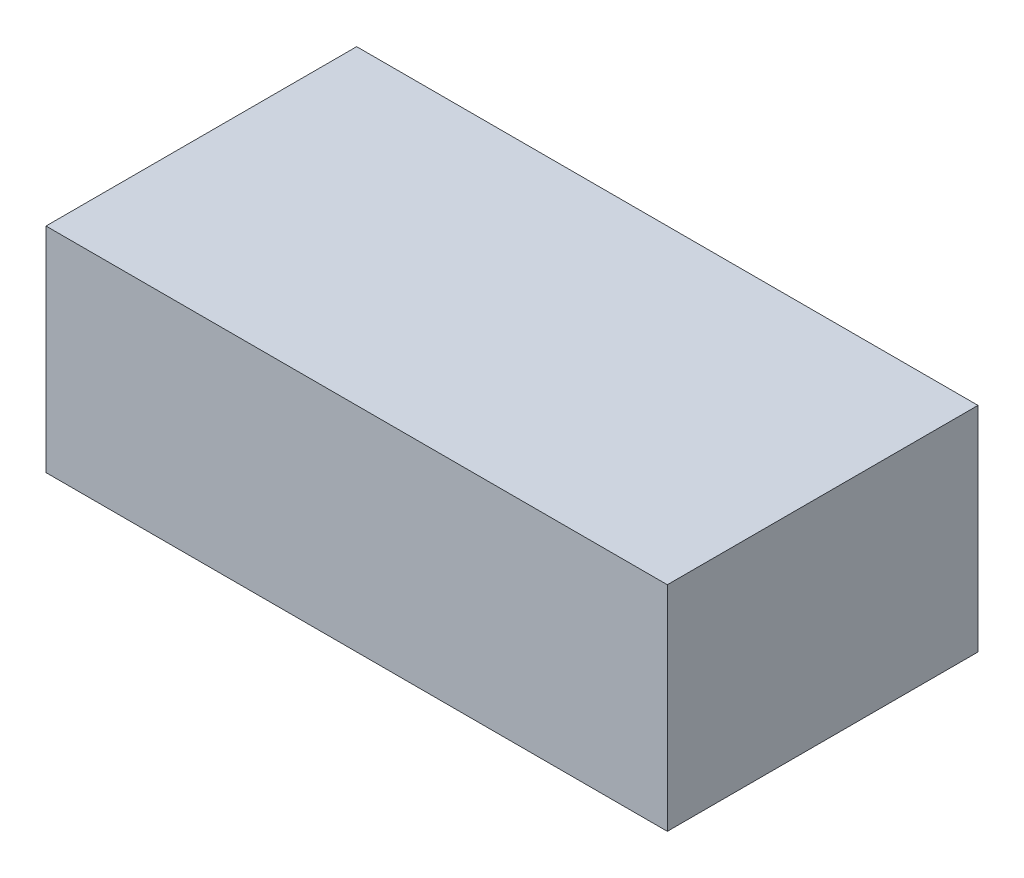
ISO-10303-21;
HEADER;
FILE_DESCRIPTION(('STEP AP214'),'2;1');
FILE_NAME('part.step','',(''),(''),'','','');
FILE_SCHEMA(('AUTOMOTIVE_DESIGN { 1 0 10303 214 1 1 1 1 }'));
ENDSEC;
DATA;
#1=APPLICATION_CONTEXT('core data for automotive mechanical design processes');
#2=APPLICATION_PROTOCOL_DEFINITION('international standard','automotive_design',2000,#1);
#3=PRODUCT_CONTEXT('',#1,'mechanical');
#4=PRODUCT('Part','Part','',(#3));
#5=PRODUCT_RELATED_PRODUCT_CATEGORY('part','',(#4));
#6=PRODUCT_DEFINITION_FORMATION('','',#4);
#7=PRODUCT_DEFINITION_CONTEXT('part definition',#1,'design');
#8=PRODUCT_DEFINITION('design','',#6,#7);
#9=PRODUCT_DEFINITION_SHAPE('','',#8);
#10=(LENGTH_UNIT() NAMED_UNIT(*) SI_UNIT(.MILLI.,.METRE.));
#11=(NAMED_UNIT(*) PLANE_ANGLE_UNIT() SI_UNIT($,.RADIAN.));
#12=(NAMED_UNIT(*) SI_UNIT($,.STERADIAN.) SOLID_ANGLE_UNIT());
#13=UNCERTAINTY_MEASURE_WITH_UNIT(LENGTH_MEASURE(1.E-05),#10,'distance_accuracy_value','');
#14=(GEOMETRIC_REPRESENTATION_CONTEXT(3) GLOBAL_UNCERTAINTY_ASSIGNED_CONTEXT((#13)) GLOBAL_UNIT_ASSIGNED_CONTEXT((#10,
#11,#12)) REPRESENTATION_CONTEXT('',''));
#15=CARTESIAN_POINT('',(0.,0.,0.));
#16=DIRECTION('',(0.,0.,1.));
#17=DIRECTION('',(1.,0.,0.));
#18=AXIS2_PLACEMENT_3D('',#15,#16,#17);
#19=CARTESIAN_POINT('',(0.8,0.55,-0.4));
#20=DIRECTION('',(-1.,0.,0.));
#21=DIRECTION('',(0.,0.,1.));
#22=AXIS2_PLACEMENT_3D('',#19,#20,#21);
#23=PLANE('',#22);
#24=DIRECTION('',(0.,0.,-1.));
#25=VECTOR('',#24,1.);
#26=CARTESIAN_POINT('',(0.8,0.,-0.4));
#27=LINE('',#26,#25);
#28=CARTESIAN_POINT('',(0.8,0.,0.4));
#29=VERTEX_POINT('',#28);
#30=CARTESIAN_POINT('',(0.8,0.,-0.4));
#31=VERTEX_POINT('',#30);
#32=EDGE_CURVE('E98',#29,#31,#27,.T.);
#33=ORIENTED_EDGE('',*,*,#32,.T.);
#34=DIRECTION('',(0.,-1.,0.));
#35=VECTOR('',#34,1.);
#36=CARTESIAN_POINT('',(0.8,0.55,-0.4));
#37=LINE('',#36,#35);
#38=CARTESIAN_POINT('',(0.8,0.55,-0.4));
#39=VERTEX_POINT('',#38);
#40=EDGE_CURVE('E11',#39,#31,#37,.T.);
#41=ORIENTED_EDGE('',*,*,#40,.F.);
#42=DIRECTION('',(0.,0.,-1.));
#43=VECTOR('',#42,1.);
#44=CARTESIAN_POINT('',(0.8,0.55,-0.4));
#45=LINE('',#44,#43);
#46=CARTESIAN_POINT('',(0.8,0.55,0.4));
#47=VERTEX_POINT('',#46);
#48=EDGE_CURVE('E86',#47,#39,#45,.T.);
#49=ORIENTED_EDGE('',*,*,#48,.F.);
#50=DIRECTION('',(0.,-1.,0.));
#51=VECTOR('',#50,1.);
#52=CARTESIAN_POINT('',(0.8,0.55,0.4));
#53=LINE('',#52,#51);
#54=EDGE_CURVE('E94',#47,#29,#53,.T.);
#55=ORIENTED_EDGE('',*,*,#54,.T.);
#56=EDGE_LOOP('',(#33,#41,#49,#55));
#57=FACE_BOUND('',#56,.T.);
#58=ADVANCED_FACE('F35',(#57),#23,.F.);
#59=CARTESIAN_POINT('',(-0.8,0.55,-0.4));
#60=DIRECTION('',(0.,0.,1.));
#61=DIRECTION('',(1.,0.,0.));
#62=AXIS2_PLACEMENT_3D('',#59,#60,#61);
#63=PLANE('',#62);
#64=DIRECTION('',(-1.,0.,0.));
#65=VECTOR('',#64,1.);
#66=CARTESIAN_POINT('',(-0.8,0.,-0.4));
#67=LINE('',#66,#65);
#68=CARTESIAN_POINT('',(-0.8,0.,-0.4));
#69=VERTEX_POINT('',#68);
#70=EDGE_CURVE('E90',#31,#69,#67,.T.);
#71=ORIENTED_EDGE('',*,*,#70,.T.);
#72=DIRECTION('',(0.,-1.,0.));
#73=VECTOR('',#72,1.);
#74=CARTESIAN_POINT('',(-0.8,0.55,-0.4));
#75=LINE('',#74,#73);
#76=CARTESIAN_POINT('',(-0.8,0.55,-0.4));
#77=VERTEX_POINT('',#76);
#78=EDGE_CURVE('E43',#77,#69,#75,.T.);
#79=ORIENTED_EDGE('',*,*,#78,.F.);
#80=DIRECTION('',(-1.,0.,0.));
#81=VECTOR('',#80,1.);
#82=CARTESIAN_POINT('',(-0.8,0.55,-0.4));
#83=LINE('',#82,#81);
#84=EDGE_CURVE('E81',#39,#77,#83,.T.);
#85=ORIENTED_EDGE('',*,*,#84,.F.);
#86=ORIENTED_EDGE('',*,*,#40,.T.);
#87=EDGE_LOOP('',(#71,#79,#85,#86));
#88=FACE_BOUND('',#87,.T.);
#89=ADVANCED_FACE('F89',(#88),#63,.F.);
#90=CARTESIAN_POINT('',(-0.8,0.55,-0.4));
#91=DIRECTION('',(1.,0.,0.));
#92=DIRECTION('',(0.,0.,-1.));
#93=AXIS2_PLACEMENT_3D('',#90,#91,#92);
#94=PLANE('',#93);
#95=DIRECTION('',(0.,0.,1.));
#96=VECTOR('',#95,1.);
#97=CARTESIAN_POINT('',(-0.8,0.,-0.4));
#98=LINE('',#97,#96);
#99=CARTESIAN_POINT('',(-0.8,0.,0.4));
#100=VERTEX_POINT('',#99);
#101=EDGE_CURVE('E68',#69,#100,#98,.T.);
#102=ORIENTED_EDGE('',*,*,#101,.T.);
#103=DIRECTION('',(0.,-1.,0.));
#104=VECTOR('',#103,1.);
#105=CARTESIAN_POINT('',(-0.8,0.55,0.4));
#106=LINE('',#105,#104);
#107=CARTESIAN_POINT('',(-0.8,0.55,0.4));
#108=VERTEX_POINT('',#107);
#109=EDGE_CURVE('E91',#108,#100,#106,.T.);
#110=ORIENTED_EDGE('',*,*,#109,.F.);
#111=DIRECTION('',(0.,0.,1.));
#112=VECTOR('',#111,1.);
#113=CARTESIAN_POINT('',(-0.8,0.55,-0.4));
#114=LINE('',#113,#112);
#115=EDGE_CURVE('E84',#77,#108,#114,.T.);
#116=ORIENTED_EDGE('',*,*,#115,.F.);
#117=ORIENTED_EDGE('',*,*,#78,.T.);
#118=EDGE_LOOP('',(#102,#110,#116,#117));
#119=FACE_BOUND('',#118,.T.);
#120=ADVANCED_FACE('F92',(#119),#94,.F.);
#121=CARTESIAN_POINT('',(-0.8,0.55,0.4));
#122=DIRECTION('',(0.,0.,-1.));
#123=DIRECTION('',(-1.,0.,0.));
#124=AXIS2_PLACEMENT_3D('',#121,#122,#123);
#125=PLANE('',#124);
#126=DIRECTION('',(1.,0.,0.));
#127=VECTOR('',#126,1.);
#128=CARTESIAN_POINT('',(-0.8,0.,0.4));
#129=LINE('',#128,#127);
#130=EDGE_CURVE('E74',#100,#29,#129,.T.);
#131=ORIENTED_EDGE('',*,*,#130,.T.);
#132=ORIENTED_EDGE('',*,*,#54,.F.);
#133=DIRECTION('',(1.,0.,0.));
#134=VECTOR('',#133,1.);
#135=CARTESIAN_POINT('',(-0.8,0.55,0.4));
#136=LINE('',#135,#134);
#137=EDGE_CURVE('E51',#108,#47,#136,.T.);
#138=ORIENTED_EDGE('',*,*,#137,.F.);
#139=ORIENTED_EDGE('',*,*,#109,.T.);
#140=EDGE_LOOP('',(#131,#132,#138,#139));
#141=FACE_BOUND('',#140,.T.);
#142=ADVANCED_FACE('F105',(#141),#125,.F.);
#143=CARTESIAN_POINT('',(0.,0.55,0.));
#144=DIRECTION('',(0.,1.,0.));
#145=DIRECTION('',(0.,0.,1.));
#146=AXIS2_PLACEMENT_3D('',#143,#144,#145);
#147=PLANE('',#146);
#148=ORIENTED_EDGE('',*,*,#48,.T.);
#149=ORIENTED_EDGE('',*,*,#84,.T.);
#150=ORIENTED_EDGE('',*,*,#115,.T.);
#151=ORIENTED_EDGE('',*,*,#137,.T.);
#152=EDGE_LOOP('',(#148,#149,#150,#151));
#153=FACE_BOUND('',#152,.T.);
#154=ADVANCED_FACE('F82',(#153),#147,.T.);
#155=CARTESIAN_POINT('',(0.,0.,0.));
#156=DIRECTION('',(0.,1.,0.));
#157=DIRECTION('',(0.,0.,1.));
#158=AXIS2_PLACEMENT_3D('',#155,#156,#157);
#159=PLANE('',#158);
#160=ORIENTED_EDGE('',*,*,#32,.F.);
#161=ORIENTED_EDGE('',*,*,#130,.F.);
#162=ORIENTED_EDGE('',*,*,#101,.F.);
#163=ORIENTED_EDGE('',*,*,#70,.F.);
#164=EDGE_LOOP('',(#160,#161,#162,#163));
#165=FACE_BOUND('',#164,.T.);
#166=ADVANCED_FACE('F108',(#165),#159,.F.);
#167=CLOSED_SHELL('',(#58,#89,#120,#142,#154,#166));
#168=MANIFOLD_SOLID_BREP('B2',#167);
#169=ADVANCED_BREP_SHAPE_REPRESENTATION('',(#18,#168),#14);
#170=SHAPE_DEFINITION_REPRESENTATION(#9,#169);
ENDSEC;
END-ISO-10303-21;
